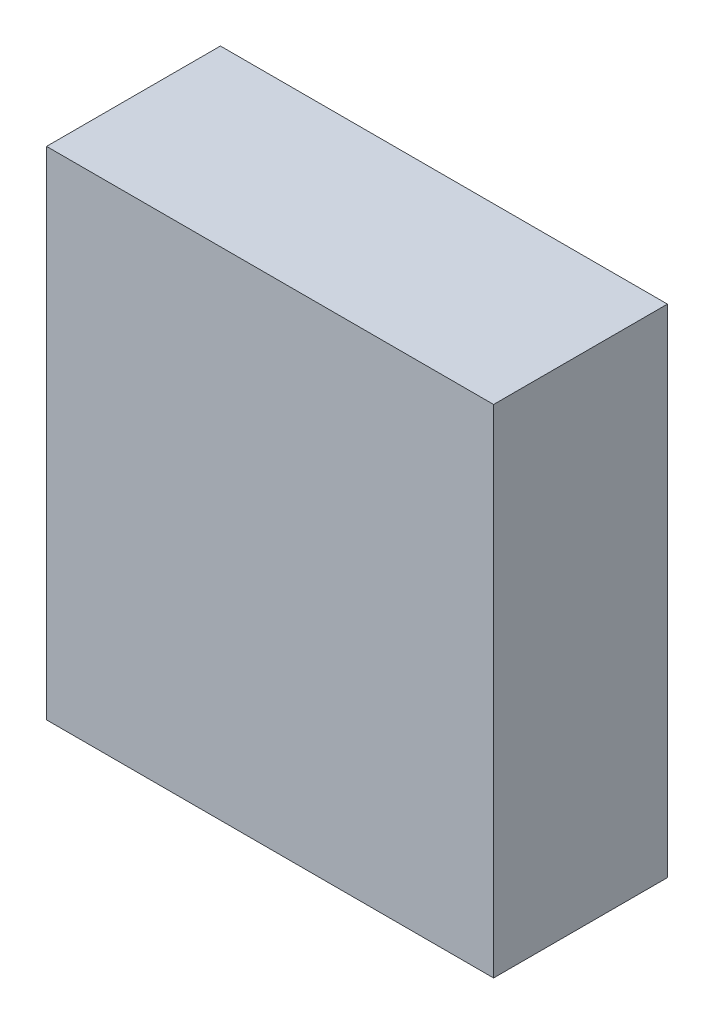
ISO-10303-21;
HEADER;
FILE_DESCRIPTION(('STEP AP214'),'2;1');
FILE_NAME('part.step','',(''),(''),'','','');
FILE_SCHEMA(('AUTOMOTIVE_DESIGN { 1 0 10303 214 1 1 1 1 }'));
ENDSEC;
DATA;
#1=APPLICATION_CONTEXT('core data for automotive mechanical design processes');
#2=APPLICATION_PROTOCOL_DEFINITION('international standard','automotive_design',2000,#1);
#3=PRODUCT_CONTEXT('',#1,'mechanical');
#4=PRODUCT('Part','Part','',(#3));
#5=PRODUCT_RELATED_PRODUCT_CATEGORY('part','',(#4));
#6=PRODUCT_DEFINITION_FORMATION('','',#4);
#7=PRODUCT_DEFINITION_CONTEXT('part definition',#1,'design');
#8=PRODUCT_DEFINITION('design','',#6,#7);
#9=PRODUCT_DEFINITION_SHAPE('','',#8);
#10=(LENGTH_UNIT() NAMED_UNIT(*) SI_UNIT(.MILLI.,.METRE.));
#11=(NAMED_UNIT(*) PLANE_ANGLE_UNIT() SI_UNIT($,.RADIAN.));
#12=(NAMED_UNIT(*) SI_UNIT($,.STERADIAN.) SOLID_ANGLE_UNIT());
#13=UNCERTAINTY_MEASURE_WITH_UNIT(LENGTH_MEASURE(1.E-05),#10,'distance_accuracy_value','');
#14=(GEOMETRIC_REPRESENTATION_CONTEXT(3) GLOBAL_UNCERTAINTY_ASSIGNED_CONTEXT((#13)) GLOBAL_UNIT_ASSIGNED_CONTEXT((#10,
#11,#12)) REPRESENTATION_CONTEXT('',''));
#15=CARTESIAN_POINT('',(0.,0.,0.));
#16=DIRECTION('',(0.,0.,1.));
#17=DIRECTION('',(1.,0.,0.));
#18=AXIS2_PLACEMENT_3D('',#15,#16,#17);
#19=CARTESIAN_POINT('',(-0.45,0.5,0.));
#20=DIRECTION('',(0.,1.,0.));
#21=DIRECTION('',(1.,0.,0.));
#22=AXIS2_PLACEMENT_3D('',#19,#20,#21);
#23=PLANE('',#22);
#24=DIRECTION('',(0.,0.,1.));
#25=VECTOR('',#24,1.);
#26=CARTESIAN_POINT('',(-0.45,0.5,0.));
#27=LINE('',#26,#25);
#28=CARTESIAN_POINT('',(-0.45,0.5,0.));
#29=VERTEX_POINT('',#28);
#30=CARTESIAN_POINT('',(-0.45,0.5,0.35));
#31=VERTEX_POINT('',#30);
#32=EDGE_CURVE('E11',#29,#31,#27,.T.);
#33=ORIENTED_EDGE('',*,*,#32,.T.);
#34=DIRECTION('',(1.,0.,0.));
#35=VECTOR('',#34,1.);
#36=CARTESIAN_POINT('',(-0.45,0.5,0.35));
#37=LINE('',#36,#35);
#38=CARTESIAN_POINT('',(0.45,0.5,0.35));
#39=VERTEX_POINT('',#38);
#40=EDGE_CURVE('E24',#31,#39,#37,.T.);
#41=ORIENTED_EDGE('',*,*,#40,.T.);
#42=DIRECTION('',(0.,0.,1.));
#43=VECTOR('',#42,1.);
#44=CARTESIAN_POINT('',(0.45,0.5,0.));
#45=LINE('',#44,#43);
#46=CARTESIAN_POINT('',(0.45,0.5,0.));
#47=VERTEX_POINT('',#46);
#48=EDGE_CURVE('E85',#47,#39,#45,.T.);
#49=ORIENTED_EDGE('',*,*,#48,.F.);
#50=DIRECTION('',(1.,0.,0.));
#51=VECTOR('',#50,1.);
#52=CARTESIAN_POINT('',(-0.45,0.5,0.));
#53=LINE('',#52,#51);
#54=EDGE_CURVE('E83',#29,#47,#53,.T.);
#55=ORIENTED_EDGE('',*,*,#54,.F.);
#56=EDGE_LOOP('',(#33,#41,#49,#55));
#57=FACE_BOUND('',#56,.T.);
#58=ADVANCED_FACE('F17',(#57),#23,.T.);
#59=CARTESIAN_POINT('',(0.45,0.5,0.));
#60=DIRECTION('',(1.,0.,0.));
#61=DIRECTION('',(0.,-1.,0.));
#62=AXIS2_PLACEMENT_3D('',#59,#60,#61);
#63=PLANE('',#62);
#64=ORIENTED_EDGE('',*,*,#48,.T.);
#65=DIRECTION('',(0.,-1.,0.));
#66=VECTOR('',#65,1.);
#67=CARTESIAN_POINT('',(0.45,0.5,0.35));
#68=LINE('',#67,#66);
#69=CARTESIAN_POINT('',(0.45,-0.5,0.35));
#70=VERTEX_POINT('',#69);
#71=EDGE_CURVE('E81',#39,#70,#68,.T.);
#72=ORIENTED_EDGE('',*,*,#71,.T.);
#73=DIRECTION('',(0.,0.,1.));
#74=VECTOR('',#73,1.);
#75=CARTESIAN_POINT('',(0.45,-0.5,0.));
#76=LINE('',#75,#74);
#77=CARTESIAN_POINT('',(0.45,-0.5,0.));
#78=VERTEX_POINT('',#77);
#79=EDGE_CURVE('E79',#78,#70,#76,.T.);
#80=ORIENTED_EDGE('',*,*,#79,.F.);
#81=DIRECTION('',(0.,-1.,0.));
#82=VECTOR('',#81,1.);
#83=CARTESIAN_POINT('',(0.45,0.5,0.));
#84=LINE('',#83,#82);
#85=EDGE_CURVE('E70',#47,#78,#84,.T.);
#86=ORIENTED_EDGE('',*,*,#85,.F.);
#87=EDGE_LOOP('',(#64,#72,#80,#86));
#88=FACE_BOUND('',#87,.T.);
#89=ADVANCED_FACE('F90',(#88),#63,.T.);
#90=CARTESIAN_POINT('',(0.45,-0.5,0.));
#91=DIRECTION('',(0.,-1.,0.));
#92=DIRECTION('',(-1.,0.,0.));
#93=AXIS2_PLACEMENT_3D('',#90,#91,#92);
#94=PLANE('',#93);
#95=ORIENTED_EDGE('',*,*,#79,.T.);
#96=DIRECTION('',(-1.,0.,0.));
#97=VECTOR('',#96,1.);
#98=CARTESIAN_POINT('',(0.45,-0.5,0.35));
#99=LINE('',#98,#97);
#100=CARTESIAN_POINT('',(-0.45,-0.5,0.35));
#101=VERTEX_POINT('',#100);
#102=EDGE_CURVE('E60',#70,#101,#99,.T.);
#103=ORIENTED_EDGE('',*,*,#102,.T.);
#104=DIRECTION('',(0.,0.,1.));
#105=VECTOR('',#104,1.);
#106=CARTESIAN_POINT('',(-0.45,-0.5,0.));
#107=LINE('',#106,#105);
#108=CARTESIAN_POINT('',(-0.45,-0.5,0.));
#109=VERTEX_POINT('',#108);
#110=EDGE_CURVE('E54',#109,#101,#107,.T.);
#111=ORIENTED_EDGE('',*,*,#110,.F.);
#112=DIRECTION('',(-1.,0.,0.));
#113=VECTOR('',#112,1.);
#114=CARTESIAN_POINT('',(0.45,-0.5,0.));
#115=LINE('',#114,#113);
#116=EDGE_CURVE('E58',#78,#109,#115,.T.);
#117=ORIENTED_EDGE('',*,*,#116,.F.);
#118=EDGE_LOOP('',(#95,#103,#111,#117));
#119=FACE_BOUND('',#118,.T.);
#120=ADVANCED_FACE('F57',(#119),#94,.T.);
#121=CARTESIAN_POINT('',(-0.45,-0.5,0.));
#122=DIRECTION('',(-1.,0.,0.));
#123=DIRECTION('',(0.,1.,0.));
#124=AXIS2_PLACEMENT_3D('',#121,#122,#123);
#125=PLANE('',#124);
#126=ORIENTED_EDGE('',*,*,#110,.T.);
#127=DIRECTION('',(0.,1.,0.));
#128=VECTOR('',#127,1.);
#129=CARTESIAN_POINT('',(-0.45,-0.5,0.35));
#130=LINE('',#129,#128);
#131=EDGE_CURVE('E71',#101,#31,#130,.T.);
#132=ORIENTED_EDGE('',*,*,#131,.T.);
#133=ORIENTED_EDGE('',*,*,#32,.F.);
#134=DIRECTION('',(0.,1.,0.));
#135=VECTOR('',#134,1.);
#136=CARTESIAN_POINT('',(-0.45,-0.5,0.));
#137=LINE('',#136,#135);
#138=EDGE_CURVE('E68',#109,#29,#137,.T.);
#139=ORIENTED_EDGE('',*,*,#138,.F.);
#140=EDGE_LOOP('',(#126,#132,#133,#139));
#141=FACE_BOUND('',#140,.T.);
#142=ADVANCED_FACE('F73',(#141),#125,.T.);
#143=CARTESIAN_POINT('',(0.,0.,0.));
#144=DIRECTION('',(0.,0.,-1.));
#145=DIRECTION('',(-1.,0.,0.));
#146=AXIS2_PLACEMENT_3D('',#143,#144,#145);
#147=PLANE('',#146);
#148=ORIENTED_EDGE('',*,*,#54,.T.);
#149=ORIENTED_EDGE('',*,*,#85,.T.);
#150=ORIENTED_EDGE('',*,*,#116,.T.);
#151=ORIENTED_EDGE('',*,*,#138,.T.);
#152=EDGE_LOOP('',(#148,#149,#150,#151));
#153=FACE_BOUND('',#152,.T.);
#154=ADVANCED_FACE('F67',(#153),#147,.T.);
#155=CARTESIAN_POINT('',(0.,0.,0.35));
#156=DIRECTION('',(0.,0.,-1.));
#157=DIRECTION('',(-1.,0.,0.));
#158=AXIS2_PLACEMENT_3D('',#155,#156,#157);
#159=PLANE('',#158);
#160=ORIENTED_EDGE('',*,*,#131,.F.);
#161=ORIENTED_EDGE('',*,*,#102,.F.);
#162=ORIENTED_EDGE('',*,*,#71,.F.);
#163=ORIENTED_EDGE('',*,*,#40,.F.);
#164=EDGE_LOOP('',(#160,#161,#162,#163));
#165=FACE_BOUND('',#164,.T.);
#166=ADVANCED_FACE('F91',(#165),#159,.F.);
#167=CLOSED_SHELL('',(#58,#89,#120,#142,#154,#166));
#168=MANIFOLD_SOLID_BREP('B1',#167);
#169=ADVANCED_BREP_SHAPE_REPRESENTATION('',(#18,#168),#14);
#170=SHAPE_DEFINITION_REPRESENTATION(#9,#169);
ENDSEC;
END-ISO-10303-21;
